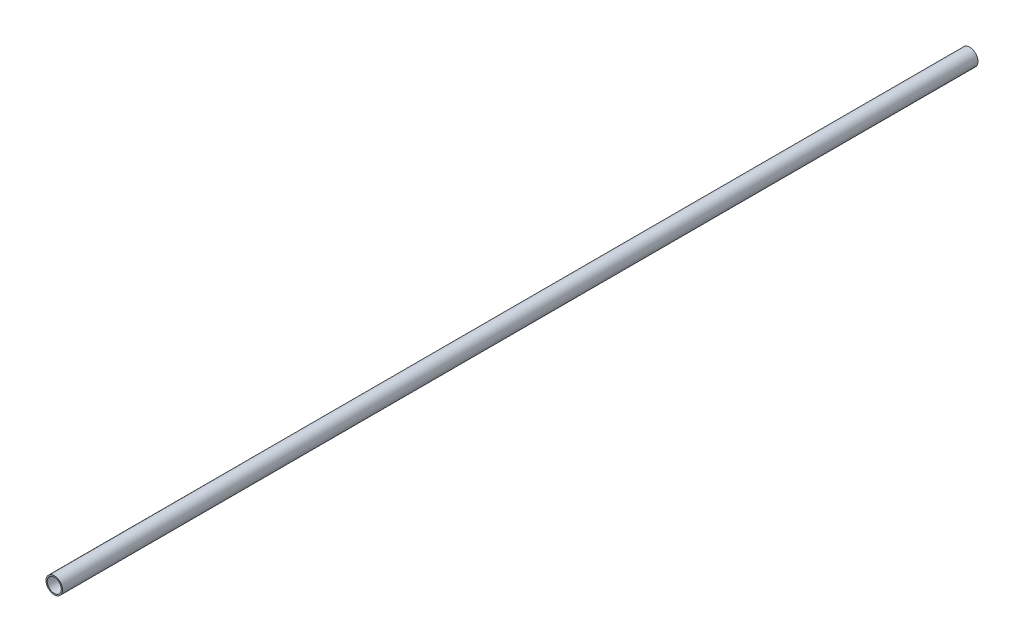
ISO-10303-21;
HEADER;
FILE_DESCRIPTION(('STEP AP214'),'2;1');
FILE_NAME('part.step','',(''),(''),'','','');
FILE_SCHEMA(('AUTOMOTIVE_DESIGN { 1 0 10303 214 1 1 1 1 }'));
ENDSEC;
DATA;
#1=APPLICATION_CONTEXT('core data for automotive mechanical design processes');
#2=APPLICATION_PROTOCOL_DEFINITION('international standard','automotive_design',2000,#1);
#3=PRODUCT_CONTEXT('',#1,'mechanical');
#4=PRODUCT('Part','Part','',(#3));
#5=PRODUCT_RELATED_PRODUCT_CATEGORY('part','',(#4));
#6=PRODUCT_DEFINITION_FORMATION('','',#4);
#7=PRODUCT_DEFINITION_CONTEXT('part definition',#1,'design');
#8=PRODUCT_DEFINITION('design','',#6,#7);
#9=PRODUCT_DEFINITION_SHAPE('','',#8);
#10=(LENGTH_UNIT() NAMED_UNIT(*) SI_UNIT(.MILLI.,.METRE.));
#11=(NAMED_UNIT(*) PLANE_ANGLE_UNIT() SI_UNIT($,.RADIAN.));
#12=(NAMED_UNIT(*) SI_UNIT($,.STERADIAN.) SOLID_ANGLE_UNIT());
#13=UNCERTAINTY_MEASURE_WITH_UNIT(LENGTH_MEASURE(1.E-05),#10,'distance_accuracy_value','');
#14=(GEOMETRIC_REPRESENTATION_CONTEXT(3) GLOBAL_UNCERTAINTY_ASSIGNED_CONTEXT((#13)) GLOBAL_UNIT_ASSIGNED_CONTEXT((#10,
#11,#12)) REPRESENTATION_CONTEXT('',''));
#15=CARTESIAN_POINT('',(0.,0.,0.));
#16=DIRECTION('',(0.,0.,1.));
#17=DIRECTION('',(1.,0.,0.));
#18=AXIS2_PLACEMENT_3D('',#15,#16,#17);
#19=CARTESIAN_POINT('',(0.,0.,263.525));
#20=DIRECTION('',(0.,0.,1.));
#21=DIRECTION('',(1.,0.,0.));
#22=AXIS2_PLACEMENT_3D('',#19,#20,#21);
#23=PLANE('',#22);
#24=CARTESIAN_POINT('',(0.,0.,263.525));
#25=DIRECTION('',(0.,0.,1.));
#26=DIRECTION('',(1.,0.,0.));
#27=AXIS2_PLACEMENT_3D('',#24,#25,#26);
#28=CIRCLE('',#27,4.7625);
#29=CARTESIAN_POINT('',(4.7625,0.,263.525));
#30=VERTEX_POINT('',#29);
#31=EDGE_CURVE('E10',#30,#30,#28,.T.);
#32=ORIENTED_EDGE('',*,*,#31,.T.);
#33=EDGE_LOOP('',(#32));
#34=FACE_BOUND('',#33,.T.);
#35=CARTESIAN_POINT('',(0.,0.,263.525));
#36=DIRECTION('',(0.,0.,1.));
#37=DIRECTION('',(1.,0.,0.));
#38=AXIS2_PLACEMENT_3D('',#35,#36,#37);
#39=CIRCLE('',#38,4.0513);
#40=CARTESIAN_POINT('',(4.0513,0.,263.525));
#41=VERTEX_POINT('',#40);
#42=EDGE_CURVE('E54',#41,#41,#39,.T.);
#43=ORIENTED_EDGE('',*,*,#42,.F.);
#44=EDGE_LOOP('',(#43));
#45=FACE_BOUND('',#44,.T.);
#46=ADVANCED_FACE('F41',(#34,#45),#23,.T.);
#47=CARTESIAN_POINT('',(0.,0.,-263.525));
#48=DIRECTION('',(0.,0.,1.));
#49=DIRECTION('',(1.,0.,0.));
#50=AXIS2_PLACEMENT_3D('',#47,#48,#49);
#51=PLANE('',#50);
#52=CARTESIAN_POINT('',(0.,0.,-263.525));
#53=DIRECTION('',(0.,0.,1.));
#54=DIRECTION('',(1.,0.,0.));
#55=AXIS2_PLACEMENT_3D('',#52,#53,#54);
#56=CIRCLE('',#55,4.7625);
#57=CARTESIAN_POINT('',(4.7625,0.,-263.525));
#58=VERTEX_POINT('',#57);
#59=EDGE_CURVE('E45',#58,#58,#56,.T.);
#60=ORIENTED_EDGE('',*,*,#59,.F.);
#61=EDGE_LOOP('',(#60));
#62=FACE_BOUND('',#61,.T.);
#63=CARTESIAN_POINT('',(0.,0.,-263.525));
#64=DIRECTION('',(0.,0.,1.));
#65=DIRECTION('',(1.,0.,0.));
#66=AXIS2_PLACEMENT_3D('',#63,#64,#65);
#67=CIRCLE('',#66,4.0513);
#68=CARTESIAN_POINT('',(4.0513,0.,-263.525));
#69=VERTEX_POINT('',#68);
#70=EDGE_CURVE('E56',#69,#69,#67,.T.);
#71=ORIENTED_EDGE('',*,*,#70,.T.);
#72=EDGE_LOOP('',(#71));
#73=FACE_BOUND('',#72,.T.);
#74=ADVANCED_FACE('F68',(#62,#73),#51,.F.);
#75=CARTESIAN_POINT('',(0.,0.,263.525));
#76=DIRECTION('',(0.,0.,-1.));
#77=DIRECTION('',(-1.,0.,0.));
#78=AXIS2_PLACEMENT_3D('',#75,#76,#77);
#79=CYLINDRICAL_SURFACE('',#78,4.7625);
#80=ORIENTED_EDGE('',*,*,#31,.F.);
#81=EDGE_LOOP('',(#80));
#82=FACE_BOUND('',#81,.T.);
#83=ORIENTED_EDGE('',*,*,#59,.T.);
#84=EDGE_LOOP('',(#83));
#85=FACE_BOUND('',#84,.T.);
#86=ADVANCED_FACE('F43',(#82,#85),#79,.T.);
#87=CARTESIAN_POINT('',(0.,0.,263.525));
#88=DIRECTION('',(0.,0.,-1.));
#89=DIRECTION('',(-1.,0.,0.));
#90=AXIS2_PLACEMENT_3D('',#87,#88,#89);
#91=CYLINDRICAL_SURFACE('',#90,4.0513);
#92=ORIENTED_EDGE('',*,*,#42,.T.);
#93=EDGE_LOOP('',(#92));
#94=FACE_BOUND('',#93,.T.);
#95=ORIENTED_EDGE('',*,*,#70,.F.);
#96=EDGE_LOOP('',(#95));
#97=FACE_BOUND('',#96,.T.);
#98=ADVANCED_FACE('F64',(#94,#97),#91,.F.);
#99=CLOSED_SHELL('',(#46,#74,#86,#98));
#100=MANIFOLD_SOLID_BREP('B2',#99);
#101=ADVANCED_BREP_SHAPE_REPRESENTATION('',(#18,#100),#14);
#102=SHAPE_DEFINITION_REPRESENTATION(#9,#101);
ENDSEC;
END-ISO-10303-21;
